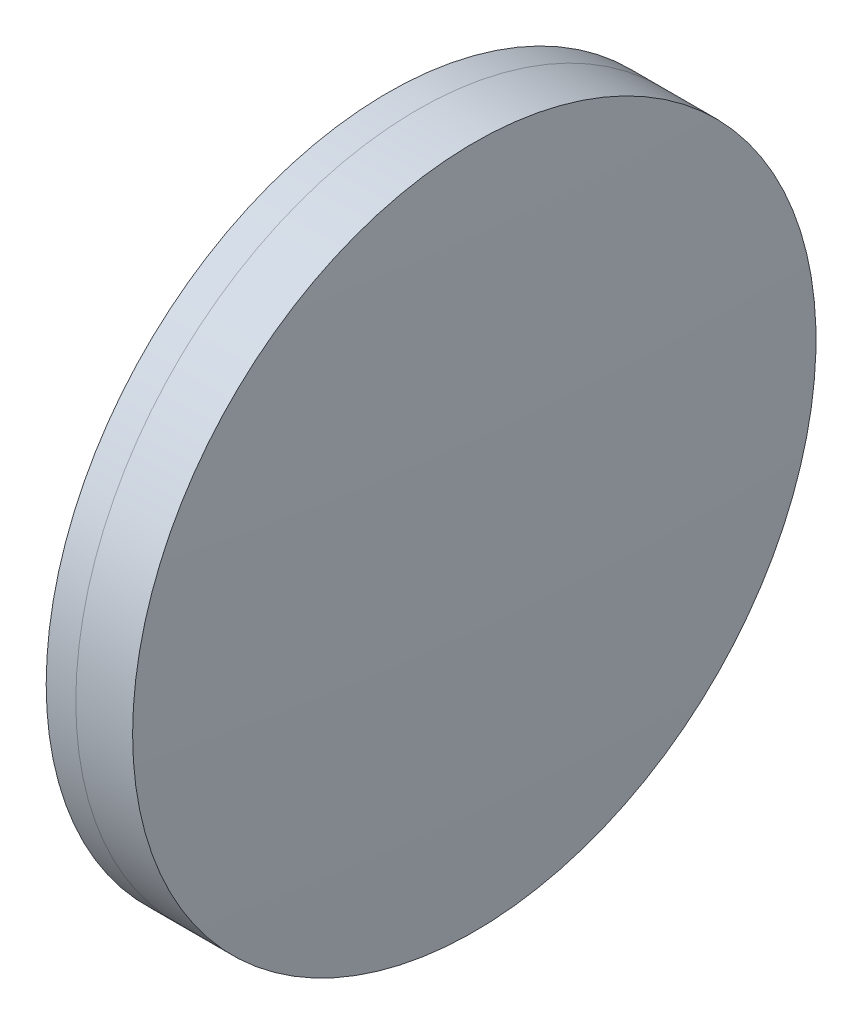
ISO-10303-21;
HEADER;
FILE_DESCRIPTION(('STEP AP214'),'2;1');
FILE_NAME('part.step','',(''),(''),'','','');
FILE_SCHEMA(('AUTOMOTIVE_DESIGN { 1 0 10303 214 1 1 1 1 }'));
ENDSEC;
DATA;
#1=APPLICATION_CONTEXT('core data for automotive mechanical design processes');
#2=APPLICATION_PROTOCOL_DEFINITION('international standard','automotive_design',2000,#1);
#3=PRODUCT_CONTEXT('',#1,'mechanical');
#4=PRODUCT('Part','Part','',(#3));
#5=PRODUCT_RELATED_PRODUCT_CATEGORY('part','',(#4));
#6=PRODUCT_DEFINITION_FORMATION('','',#4);
#7=PRODUCT_DEFINITION_CONTEXT('part definition',#1,'design');
#8=PRODUCT_DEFINITION('design','',#6,#7);
#9=PRODUCT_DEFINITION_SHAPE('','',#8);
#10=(LENGTH_UNIT() NAMED_UNIT(*) SI_UNIT(.MILLI.,.METRE.));
#11=(NAMED_UNIT(*) PLANE_ANGLE_UNIT() SI_UNIT($,.RADIAN.));
#12=(NAMED_UNIT(*) SI_UNIT($,.STERADIAN.) SOLID_ANGLE_UNIT());
#13=UNCERTAINTY_MEASURE_WITH_UNIT(LENGTH_MEASURE(1.E-05),#10,'distance_accuracy_value','');
#14=(GEOMETRIC_REPRESENTATION_CONTEXT(3) GLOBAL_UNCERTAINTY_ASSIGNED_CONTEXT((#13)) GLOBAL_UNIT_ASSIGNED_CONTEXT((#10,
#11,#12)) REPRESENTATION_CONTEXT('',''));
#15=CARTESIAN_POINT('',(0.,0.,0.));
#16=DIRECTION('',(0.,0.,1.));
#17=DIRECTION('',(1.,0.,0.));
#18=AXIS2_PLACEMENT_3D('',#15,#16,#17);
#19=CARTESIAN_POINT('',(257.621782443091,0.,0.));
#20=DIRECTION('',(-1.,0.,0.));
#21=DIRECTION('',(0.,0.,1.));
#22=AXIS2_PLACEMENT_3D('',#19,#20,#21);
#23=SPHERICAL_SURFACE('',#22,111.7);
#24=CARTESIAN_POINT('',(366.395538469074,0.,0.));
#25=DIRECTION('',(-1.,0.,0.));
#26=DIRECTION('',(0.,0.,1.));
#27=AXIS2_PLACEMENT_3D('',#24,#25,#26);
#28=CIRCLE('',#27,25.4);
#29=CARTESIAN_POINT('',(366.395538469074,0.,25.4));
#30=VERTEX_POINT('',#29);
#31=EDGE_CURVE('E11',#30,#30,#28,.T.);
#32=ORIENTED_EDGE('',*,*,#31,.T.);
#33=EDGE_LOOP('',(#32));
#34=FACE_BOUND('',#33,.T.);
#35=ADVANCED_FACE('F45',(#34),#23,.F.);
#36=CARTESIAN_POINT('',(-0.551919992657797,0.,0.));
#37=DIRECTION('',(-1.,0.,0.));
#38=DIRECTION('',(0.,0.,1.));
#39=AXIS2_PLACEMENT_3D('',#36,#37,#38);
#40=CYLINDRICAL_SURFACE('',#39,25.4);
#41=CARTESIAN_POINT('',(370.618761713402,0.,0.));
#42=DIRECTION('',(-1.,0.,0.));
#43=DIRECTION('',(0.,0.,1.));
#44=AXIS2_PLACEMENT_3D('',#41,#42,#43);
#45=CIRCLE('',#44,25.4);
#46=CARTESIAN_POINT('',(370.618761713402,0.,25.4));
#47=VERTEX_POINT('',#46);
#48=EDGE_CURVE('E51',#47,#47,#45,.T.);
#49=ORIENTED_EDGE('',*,*,#48,.T.);
#50=EDGE_LOOP('',(#49));
#51=FACE_BOUND('',#50,.T.);
#52=ORIENTED_EDGE('',*,*,#31,.F.);
#53=EDGE_LOOP('',(#52));
#54=FACE_BOUND('',#53,.T.);
#55=ADVANCED_FACE('F57',(#51,#54),#40,.T.);
#56=CARTESIAN_POINT('',(-87.8782175569087,0.,0.));
#57=DIRECTION('',(-1.,0.,0.));
#58=DIRECTION('',(0.,0.,1.));
#59=AXIS2_PLACEMENT_3D('',#56,#57,#58);
#60=SPHERICAL_SURFACE('',#59,459.2);
#61=ORIENTED_EDGE('',*,*,#48,.F.);
#62=EDGE_LOOP('',(#61));
#63=FACE_BOUND('',#62,.T.);
#64=ADVANCED_FACE('F60',(#63),#60,.T.);
#65=CLOSED_SHELL('',(#35,#55,#64));
#66=MANIFOLD_SOLID_BREP('B2',#65);
#67=CARTESIAN_POINT('',(498.921782443091,0.,0.));
#68=DIRECTION('',(-1.,0.,0.));
#69=DIRECTION('',(0.,0.,1.));
#70=AXIS2_PLACEMENT_3D('',#67,#68,#69);
#71=SPHERICAL_SURFACE('',#70,137.1);
#72=CARTESIAN_POINT('',(364.195207484771,0.,0.));
#73=DIRECTION('',(-1.,0.,0.));
#74=DIRECTION('',(0.,0.,1.));
#75=AXIS2_PLACEMENT_3D('',#72,#73,#74);
#76=CIRCLE('',#75,25.4);
#77=CARTESIAN_POINT('',(364.195207484771,0.,25.4));
#78=VERTEX_POINT('',#77);
#79=EDGE_CURVE('E44',#78,#78,#76,.T.);
#80=ORIENTED_EDGE('',*,*,#79,.T.);
#81=EDGE_LOOP('',(#80));
#82=FACE_BOUND('',#81,.T.);
#83=ADVANCED_FACE('F86',(#82),#71,.T.);
#84=CARTESIAN_POINT('',(124.523309526045,0.,0.));
#85=DIRECTION('',(-1.,0.,0.));
#86=DIRECTION('',(0.,0.,1.));
#87=AXIS2_PLACEMENT_3D('',#84,#85,#86);
#88=CYLINDRICAL_SURFACE('',#87,25.4);
#89=CARTESIAN_POINT('',(366.395538469074,0.,0.));
#90=DIRECTION('',(-1.,0.,0.));
#91=DIRECTION('',(0.,0.,1.));
#92=AXIS2_PLACEMENT_3D('',#89,#90,#91);
#93=CIRCLE('',#92,25.4);
#94=CARTESIAN_POINT('',(366.395538469074,0.,25.4));
#95=VERTEX_POINT('',#94);
#96=EDGE_CURVE('E92',#95,#95,#93,.T.);
#97=ORIENTED_EDGE('',*,*,#96,.T.);
#98=EDGE_LOOP('',(#97));
#99=FACE_BOUND('',#98,.T.);
#100=ORIENTED_EDGE('',*,*,#79,.F.);
#101=EDGE_LOOP('',(#100));
#102=FACE_BOUND('',#101,.T.);
#103=ADVANCED_FACE('F98',(#99,#102),#88,.T.);
#104=CARTESIAN_POINT('',(257.621782443091,0.,0.));
#105=DIRECTION('',(-1.,0.,0.));
#106=DIRECTION('',(0.,0.,1.));
#107=AXIS2_PLACEMENT_3D('',#104,#105,#106);
#108=SPHERICAL_SURFACE('',#107,111.7);
#109=ORIENTED_EDGE('',*,*,#96,.F.);
#110=EDGE_LOOP('',(#109));
#111=FACE_BOUND('',#110,.T.);
#112=ADVANCED_FACE('F101',(#111),#108,.T.);
#113=CLOSED_SHELL('',(#83,#103,#112));
#114=MANIFOLD_SOLID_BREP('B6',#113);
#115=ADVANCED_BREP_SHAPE_REPRESENTATION('',(#18,#66,#114),#14);
#116=SHAPE_DEFINITION_REPRESENTATION(#9,#115);
ENDSEC;
END-ISO-10303-21;
